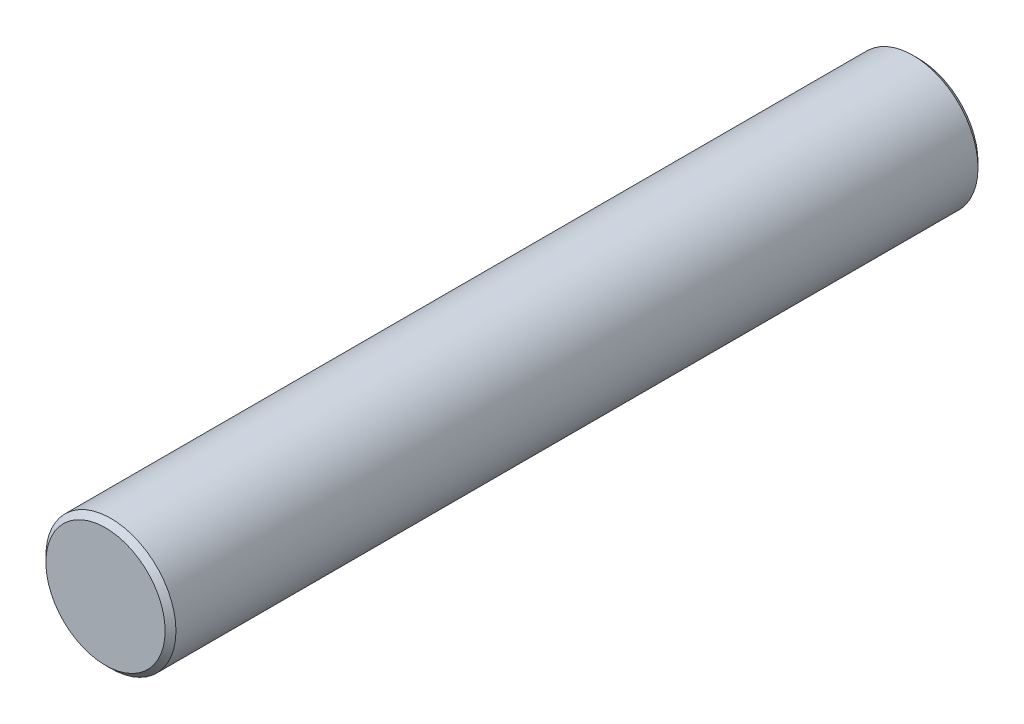
ISO-10303-21;
HEADER;
FILE_DESCRIPTION(('STEP AP214'),'2;1');
FILE_NAME('part.step','',(''),(''),'','','');
FILE_SCHEMA(('AUTOMOTIVE_DESIGN { 1 0 10303 214 1 1 1 1 }'));
ENDSEC;
DATA;
#1=APPLICATION_CONTEXT('core data for automotive mechanical design processes');
#2=APPLICATION_PROTOCOL_DEFINITION('international standard','automotive_design',2000,#1);
#3=PRODUCT_CONTEXT('',#1,'mechanical');
#4=PRODUCT('Part','Part','',(#3));
#5=PRODUCT_RELATED_PRODUCT_CATEGORY('part','',(#4));
#6=PRODUCT_DEFINITION_FORMATION('','',#4);
#7=PRODUCT_DEFINITION_CONTEXT('part definition',#1,'design');
#8=PRODUCT_DEFINITION('design','',#6,#7);
#9=PRODUCT_DEFINITION_SHAPE('','',#8);
#10=(LENGTH_UNIT() NAMED_UNIT(*) SI_UNIT(.MILLI.,.METRE.));
#11=(NAMED_UNIT(*) PLANE_ANGLE_UNIT() SI_UNIT($,.RADIAN.));
#12=(NAMED_UNIT(*) SI_UNIT($,.STERADIAN.) SOLID_ANGLE_UNIT());
#13=UNCERTAINTY_MEASURE_WITH_UNIT(LENGTH_MEASURE(1.E-05),#10,'distance_accuracy_value','');
#14=(GEOMETRIC_REPRESENTATION_CONTEXT(3) GLOBAL_UNCERTAINTY_ASSIGNED_CONTEXT((#13)) GLOBAL_UNIT_ASSIGNED_CONTEXT((#10,
#11,#12)) REPRESENTATION_CONTEXT('',''));
#15=CARTESIAN_POINT('',(0.,0.,0.));
#16=DIRECTION('',(0.,0.,1.));
#17=DIRECTION('',(1.,0.,0.));
#18=AXIS2_PLACEMENT_3D('',#15,#16,#17);
#19=CARTESIAN_POINT('',(0.,0.,0.500000000005675));
#20=DIRECTION('',(0.,0.,1.));
#21=DIRECTION('',(1.,0.,0.));
#22=AXIS2_PLACEMENT_3D('',#19,#20,#21);
#23=CONICAL_SURFACE('',#22,5.99999999992111,0.785398163397449);
#24=CARTESIAN_POINT('',(0.,0.,3.4110958336707E-11));
#25=DIRECTION('',(0.,0.,1.));
#26=DIRECTION('',(1.,0.,0.));
#27=AXIS2_PLACEMENT_3D('',#24,#25,#26);
#28=CIRCLE('',#27,5.49999999994955);
#29=CARTESIAN_POINT('',(5.49999999994954,0.,3.4110258664905E-11));
#30=VERTEX_POINT('',#29);
#31=EDGE_CURVE('E60',#30,#30,#28,.T.);
#32=ORIENTED_EDGE('',*,*,#31,.T.);
#33=EDGE_LOOP('',(#32));
#34=FACE_BOUND('',#33,.T.);
#35=CARTESIAN_POINT('',(0.,0.,0.500000000005675));
#36=DIRECTION('',(0.,0.,1.));
#37=DIRECTION('',(1.,0.,0.));
#38=AXIS2_PLACEMENT_3D('',#35,#36,#37);
#39=CIRCLE('',#38,5.99999999992111);
#40=CARTESIAN_POINT('',(5.9999999999211,0.,0.500000000005675));
#41=VERTEX_POINT('',#40);
#42=EDGE_CURVE('E10',#41,#41,#39,.T.);
#43=ORIENTED_EDGE('',*,*,#42,.F.);
#44=EDGE_LOOP('',(#43));
#45=FACE_BOUND('',#44,.T.);
#46=ADVANCED_FACE('F43',(#34,#45),#23,.T.);
#47=CARTESIAN_POINT('',(0.,0.,3.41109322206445E-11));
#48=DIRECTION('',(0.,0.,1.));
#49=DIRECTION('',(1.,0.,0.));
#50=AXIS2_PLACEMENT_3D('',#47,#48,#49);
#51=CYLINDRICAL_SURFACE('',#50,5.99999999992111);
#52=ORIENTED_EDGE('',*,*,#42,.T.);
#53=EDGE_LOOP('',(#52));
#54=FACE_BOUND('',#53,.T.);
#55=CARTESIAN_POINT('',(0.,0.,74.5000000000057));
#56=DIRECTION('',(0.,0.,1.));
#57=DIRECTION('',(1.,0.,0.));
#58=AXIS2_PLACEMENT_3D('',#55,#56,#57);
#59=CIRCLE('',#58,5.9999999999211);
#60=CARTESIAN_POINT('',(5.9999999999211,0.,74.5000000000057));
#61=VERTEX_POINT('',#60);
#62=EDGE_CURVE('E50',#61,#61,#59,.T.);
#63=ORIENTED_EDGE('',*,*,#62,.F.);
#64=EDGE_LOOP('',(#63));
#65=FACE_BOUND('',#64,.T.);
#66=ADVANCED_FACE('F80',(#54,#65),#51,.T.);
#67=CARTESIAN_POINT('',(0.,0.,75.));
#68=DIRECTION('',(0.,0.,-1.));
#69=DIRECTION('',(-1.,0.,0.));
#70=AXIS2_PLACEMENT_3D('',#67,#68,#69);
#71=CONICAL_SURFACE('',#70,5.49999999992679,0.78539816339745);
#72=ORIENTED_EDGE('',*,*,#62,.T.);
#73=EDGE_LOOP('',(#72));
#74=FACE_BOUND('',#73,.T.);
#75=CARTESIAN_POINT('',(0.,0.,75.));
#76=DIRECTION('',(0.,0.,1.));
#77=DIRECTION('',(1.,0.,0.));
#78=AXIS2_PLACEMENT_3D('',#75,#76,#77);
#79=CIRCLE('',#78,5.49999999992679);
#80=CARTESIAN_POINT('',(5.49999999992679,0.,75.));
#81=VERTEX_POINT('',#80);
#82=EDGE_CURVE('E55',#81,#81,#79,.T.);
#83=ORIENTED_EDGE('',*,*,#82,.F.);
#84=EDGE_LOOP('',(#83));
#85=FACE_BOUND('',#84,.T.);
#86=ADVANCED_FACE('F76',(#74,#85),#71,.T.);
#87=CARTESIAN_POINT('',(0.,0.,75.));
#88=DIRECTION('',(0.,0.,1.));
#89=DIRECTION('',(1.,0.,0.));
#90=AXIS2_PLACEMENT_3D('',#87,#88,#89);
#91=PLANE('',#90);
#92=ORIENTED_EDGE('',*,*,#82,.T.);
#93=EDGE_LOOP('',(#92));
#94=FACE_BOUND('',#93,.T.);
#95=ADVANCED_FACE('F71',(#94),#91,.T.);
#96=CARTESIAN_POINT('',(5.49999999994954,0.,3.41102456068738E-11));
#97=DIRECTION('',(0.,0.,-1.));
#98=DIRECTION('',(-1.,0.,0.));
#99=AXIS2_PLACEMENT_3D('',#96,#97,#98);
#100=PLANE('',#99);
#101=ORIENTED_EDGE('',*,*,#31,.F.);
#102=EDGE_LOOP('',(#101));
#103=FACE_BOUND('',#102,.T.);
#104=ADVANCED_FACE('F69',(#103),#100,.T.);
#105=CLOSED_SHELL('',(#46,#66,#86,#95,#104));
#106=MANIFOLD_SOLID_BREP('B2',#105);
#107=ADVANCED_BREP_SHAPE_REPRESENTATION('',(#18,#106),#14);
#108=SHAPE_DEFINITION_REPRESENTATION(#9,#107);
ENDSEC;
END-ISO-10303-21;
